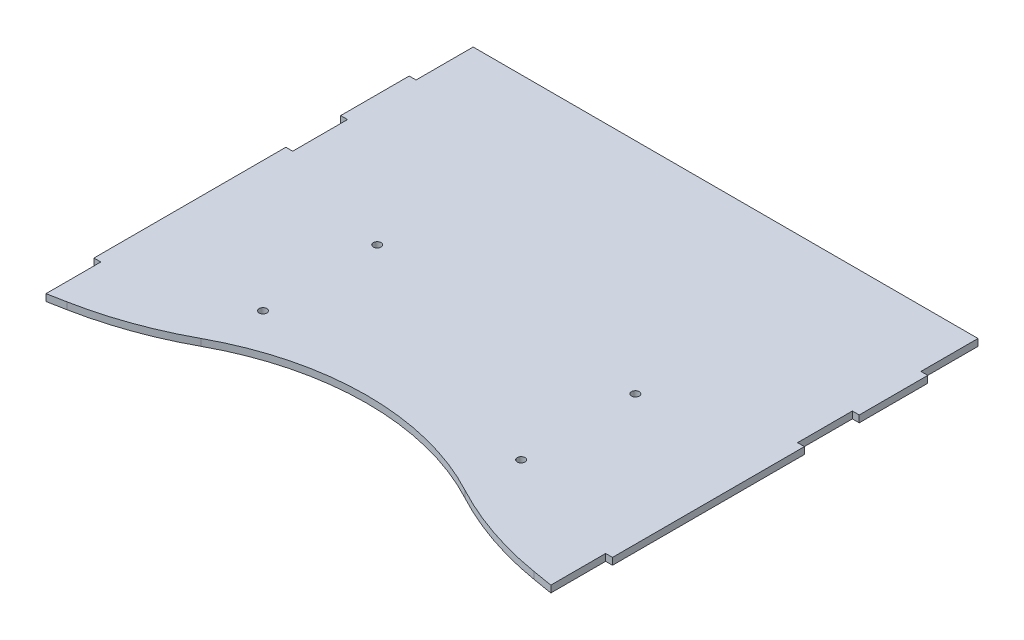
ISO-10303-21;
HEADER;
FILE_DESCRIPTION(('STEP AP214'),'2;1');
FILE_NAME('part.step','',(''),(''),'','','');
FILE_SCHEMA(('AUTOMOTIVE_DESIGN { 1 0 10303 214 1 1 1 1 }'));
ENDSEC;
DATA;
#1=APPLICATION_CONTEXT('core data for automotive mechanical design processes');
#2=APPLICATION_PROTOCOL_DEFINITION('international standard','automotive_design',2000,#1);
#3=PRODUCT_CONTEXT('',#1,'mechanical');
#4=PRODUCT('Part','Part','',(#3));
#5=PRODUCT_RELATED_PRODUCT_CATEGORY('part','',(#4));
#6=PRODUCT_DEFINITION_FORMATION('','',#4);
#7=PRODUCT_DEFINITION_CONTEXT('part definition',#1,'design');
#8=PRODUCT_DEFINITION('design','',#6,#7);
#9=PRODUCT_DEFINITION_SHAPE('','',#8);
#10=(LENGTH_UNIT() NAMED_UNIT(*) SI_UNIT(.MILLI.,.METRE.));
#11=(NAMED_UNIT(*) PLANE_ANGLE_UNIT() SI_UNIT($,.RADIAN.));
#12=(NAMED_UNIT(*) SI_UNIT($,.STERADIAN.) SOLID_ANGLE_UNIT());
#13=UNCERTAINTY_MEASURE_WITH_UNIT(LENGTH_MEASURE(1.E-05),#10,'distance_accuracy_value','');
#14=(GEOMETRIC_REPRESENTATION_CONTEXT(3) GLOBAL_UNCERTAINTY_ASSIGNED_CONTEXT((#13)) GLOBAL_UNIT_ASSIGNED_CONTEXT((#10,
#11,#12)) REPRESENTATION_CONTEXT('',''));
#15=CARTESIAN_POINT('',(0.,0.,0.));
#16=DIRECTION('',(0.,0.,1.));
#17=DIRECTION('',(1.,0.,0.));
#18=AXIS2_PLACEMENT_3D('',#15,#16,#17);
#19=CARTESIAN_POINT('',(-119.988319576707,3.,-50.7864686488141));
#20=DIRECTION('',(0.,1.,0.));
#21=DIRECTION('',(0.,0.,1.));
#22=AXIS2_PLACEMENT_3D('',#19,#20,#21);
#23=PLANE('',#22);
#24=CARTESIAN_POINT('',(67.6229243621729,3.,56.9943063968676));
#25=DIRECTION('',(0.,1.,0.));
#26=DIRECTION('',(0.,0.,1.));
#27=AXIS2_PLACEMENT_3D('',#24,#25,#26);
#28=CIRCLE('',#27,1.70000000000836);
#29=CARTESIAN_POINT('',(67.6229243621729,3.,58.694306396876));
#30=VERTEX_POINT('',#29);
#31=EDGE_CURVE('E532',#30,#30,#28,.T.);
#32=ORIENTED_EDGE('',*,*,#31,.F.);
#33=EDGE_LOOP('',(#32));
#34=FACE_BOUND('',#33,.T.);
#35=CARTESIAN_POINT('',(-45.3780371580943,3.,56.9943063968676));
#36=DIRECTION('',(0.,1.,0.));
#37=DIRECTION('',(0.,0.,-1.));
#38=AXIS2_PLACEMENT_3D('',#35,#36,#37);
#39=CIRCLE('',#38,1.70000000000835);
#40=CARTESIAN_POINT('',(-45.3780371580943,3.,55.2943063968593));
#41=VERTEX_POINT('',#40);
#42=EDGE_CURVE('E250',#41,#41,#39,.T.);
#43=ORIENTED_EDGE('',*,*,#42,.F.);
#44=EDGE_LOOP('',(#43));
#45=FACE_BOUND('',#44,.T.);
#46=DIRECTION('',(1.,0.,0.));
#47=VECTOR('',#46,1.);
#48=CARTESIAN_POINT('',(121.622443602039,3.,-34.0058768468031));
#49=LINE('',#48,#47);
#50=CARTESIAN_POINT('',(121.622443602039,3.,-34.0058768468031));
#51=VERTEX_POINT('',#50);
#52=CARTESIAN_POINT('',(124.622443602039,3.,-34.0058768468031));
#53=VERTEX_POINT('',#52);
#54=EDGE_CURVE('E316',#51,#53,#49,.T.);
#55=ORIENTED_EDGE('',*,*,#54,.T.);
#56=DIRECTION('',(0.,0.,-1.));
#57=VECTOR('',#56,1.);
#58=CARTESIAN_POINT('',(124.622443602039,3.,-34.0058768468031));
#59=LINE('',#58,#57);
#60=CARTESIAN_POINT('',(124.622443602039,3.,-64.0058768468031));
#61=VERTEX_POINT('',#60);
#62=EDGE_CURVE('E156',#53,#61,#59,.T.);
#63=ORIENTED_EDGE('',*,*,#62,.T.);
#64=DIRECTION('',(-1.,0.,0.));
#65=VECTOR('',#64,1.);
#66=CARTESIAN_POINT('',(124.622443602039,3.,-64.0058768468031));
#67=LINE('',#66,#65);
#68=CARTESIAN_POINT('',(121.622443602039,3.,-64.0058768468031));
#69=VERTEX_POINT('',#68);
#70=EDGE_CURVE('E401',#61,#69,#67,.T.);
#71=ORIENTED_EDGE('',*,*,#70,.T.);
#72=DIRECTION('',(0.,0.,-1.));
#73=VECTOR('',#72,1.);
#74=CARTESIAN_POINT('',(121.622443602039,3.,-64.0058768468031));
#75=LINE('',#74,#73);
#76=CARTESIAN_POINT('',(121.622443602039,3.,-89.0051120694086));
#77=VERTEX_POINT('',#76);
#78=EDGE_CURVE('E421',#69,#77,#75,.T.);
#79=ORIENTED_EDGE('',*,*,#78,.T.);
#80=DIRECTION('',(-0.999999999994578,0.,-3.29287633006143E-06));
#81=VECTOR('',#80,1.);
#82=CARTESIAN_POINT('',(-99.3775563979607,3.,-89.0058397950775));
#83=LINE('',#82,#81);
#84=CARTESIAN_POINT('',(-99.3775563979607,3.,-89.0058397950775));
#85=VERTEX_POINT('',#84);
#86=EDGE_CURVE('E417',#77,#85,#83,.T.);
#87=ORIENTED_EDGE('',*,*,#86,.T.);
#88=DIRECTION('',(0.,0.,1.));
#89=VECTOR('',#88,1.);
#90=CARTESIAN_POINT('',(-99.3775563979607,3.,-64.0058768468031));
#91=LINE('',#90,#89);
#92=CARTESIAN_POINT('',(-99.3775563979607,3.,-64.0058768468031));
#93=VERTEX_POINT('',#92);
#94=EDGE_CURVE('E420',#85,#93,#91,.T.);
#95=ORIENTED_EDGE('',*,*,#94,.T.);
#96=DIRECTION('',(-1.,0.,0.));
#97=VECTOR('',#96,1.);
#98=CARTESIAN_POINT('',(-102.377556397961,3.,-64.0058768468031));
#99=LINE('',#98,#97);
#100=CARTESIAN_POINT('',(-102.377556397961,3.,-64.0058768468031));
#101=VERTEX_POINT('',#100);
#102=EDGE_CURVE('E425',#93,#101,#99,.T.);
#103=ORIENTED_EDGE('',*,*,#102,.T.);
#104=DIRECTION('',(0.,0.,1.));
#105=VECTOR('',#104,1.);
#106=CARTESIAN_POINT('',(-102.377556397961,3.,-34.0058768468031));
#107=LINE('',#106,#105);
#108=CARTESIAN_POINT('',(-102.377556397961,3.,-34.0058768468031));
#109=VERTEX_POINT('',#108);
#110=EDGE_CURVE('E432',#101,#109,#107,.T.);
#111=ORIENTED_EDGE('',*,*,#110,.T.);
#112=DIRECTION('',(1.,0.,0.));
#113=VECTOR('',#112,1.);
#114=CARTESIAN_POINT('',(-99.3775563979607,3.,-34.0058768468031));
#115=LINE('',#114,#113);
#116=CARTESIAN_POINT('',(-99.3775563979607,3.,-34.0058768468031));
#117=VERTEX_POINT('',#116);
#118=EDGE_CURVE('E435',#109,#117,#115,.T.);
#119=ORIENTED_EDGE('',*,*,#118,.T.);
#120=DIRECTION('',(0.,0.,1.));
#121=VECTOR('',#120,1.);
#122=CARTESIAN_POINT('',(-99.3775563979607,3.,-10.0058768468031));
#123=LINE('',#122,#121);
#124=CARTESIAN_POINT('',(-99.3775563979607,3.,-10.0058768468031));
#125=VERTEX_POINT('',#124);
#126=EDGE_CURVE('E438',#117,#125,#123,.T.);
#127=ORIENTED_EDGE('',*,*,#126,.T.);
#128=DIRECTION('',(-1.,0.,0.));
#129=VECTOR('',#128,1.);
#130=CARTESIAN_POINT('',(-99.3775563979607,3.,-10.0058768468031));
#131=LINE('',#130,#129);
#132=CARTESIAN_POINT('',(-102.377556397961,3.,-10.0058768468031));
#133=VERTEX_POINT('',#132);
#134=EDGE_CURVE('E441',#125,#133,#131,.T.);
#135=ORIENTED_EDGE('',*,*,#134,.T.);
#136=DIRECTION('',(0.,0.,1.));
#137=VECTOR('',#136,1.);
#138=CARTESIAN_POINT('',(-102.377556397961,3.,-10.0058768468031));
#139=LINE('',#138,#137);
#140=CARTESIAN_POINT('',(-102.377556397961,3.,73.9941231531969));
#141=VERTEX_POINT('',#140);
#142=EDGE_CURVE('E444',#133,#141,#139,.T.);
#143=ORIENTED_EDGE('',*,*,#142,.T.);
#144=DIRECTION('',(1.,0.,0.));
#145=VECTOR('',#144,1.);
#146=CARTESIAN_POINT('',(-102.377556397961,3.,73.9941231531969));
#147=LINE('',#146,#145);
#148=CARTESIAN_POINT('',(-99.3775563979607,3.,73.9941231531969));
#149=VERTEX_POINT('',#148);
#150=EDGE_CURVE('E447',#141,#149,#147,.T.);
#151=ORIENTED_EDGE('',*,*,#150,.T.);
#152=DIRECTION('',(0.,0.,1.));
#153=VECTOR('',#152,1.);
#154=CARTESIAN_POINT('',(-99.3775563979607,3.,73.9941231531969));
#155=LINE('',#154,#153);
#156=CARTESIAN_POINT('',(-99.3775563979607,3.,97.9941231531969));
#157=VERTEX_POINT('',#156);
#158=EDGE_CURVE('E450',#149,#157,#155,.T.);
#159=ORIENTED_EDGE('',*,*,#158,.T.);
#160=DIRECTION('',(0.982108036493537,0.,-0.188318359845262));
#161=VECTOR('',#160,1.);
#162=CARTESIAN_POINT('',(-99.3775563979607,3.,97.9941231531969));
#163=LINE('',#162,#161);
#164=CARTESIAN_POINT('',(-91.7405655999169,3.,96.5297368252164));
#165=VERTEX_POINT('',#164);
#166=EDGE_CURVE('E453',#157,#165,#163,.T.);
#167=ORIENTED_EDGE('',*,*,#166,.T.);
#168=CARTESIAN_POINT('',(-119.988319576707,3.,-50.7864686488141));
#169=DIRECTION('',(0.,1.,0.));
#170=DIRECTION('',(0.,0.,1.));
#171=AXIS2_PLACEMENT_3D('',#168,#169,#170);
#172=CIRCLE('',#171,150.);
#173=CARTESIAN_POINT('',(-48.3937251013015,3.,81.0248132731151));
#174=VERTEX_POINT('',#173);
#175=EDGE_CURVE('E456',#165,#174,#172,.T.);
#176=ORIENTED_EDGE('',*,*,#175,.T.);
#177=CARTESIAN_POINT('',(9.42789835659181,3.,187.478971811722));
#178=DIRECTION('',(0.,-1.,0.));
#179=DIRECTION('',(0.,0.,1.));
#180=AXIS2_PLACEMENT_3D('',#177,#178,#179);
#181=CIRCLE('',#180,121.143831908476);
#182=CARTESIAN_POINT('',(66.7383594456825,3.,80.7487555689677));
#183=VERTEX_POINT('',#182);
#184=EDGE_CURVE('E459',#174,#183,#181,.T.);
#185=ORIENTED_EDGE('',*,*,#184,.T.);
#186=CARTESIAN_POINT('',(137.700033910943,3.,-51.4043403353141));
#187=DIRECTION('',(0.,1.,0.));
#188=DIRECTION('',(0.,0.,-1.));
#189=AXIS2_PLACEMENT_3D('',#186,#187,#188);
#190=CIRCLE('',#189,150.);
#191=CARTESIAN_POINT('',(112.890583802926,3.,96.5297368252164));
#192=VERTEX_POINT('',#191);
#193=EDGE_CURVE('E462',#183,#192,#190,.T.);
#194=ORIENTED_EDGE('',*,*,#193,.T.);
#195=DIRECTION('',(0.986227181070204,0.,0.165396334053447));
#196=VECTOR('',#195,1.);
#197=CARTESIAN_POINT('',(121.622443602039,3.,97.9941231531969));
#198=LINE('',#197,#196);
#199=CARTESIAN_POINT('',(121.622443602039,3.,97.9941231531969));
#200=VERTEX_POINT('',#199);
#201=EDGE_CURVE('E465',#192,#200,#198,.T.);
#202=ORIENTED_EDGE('',*,*,#201,.T.);
#203=DIRECTION('',(0.,0.,-1.));
#204=VECTOR('',#203,1.);
#205=CARTESIAN_POINT('',(121.622443602039,3.,73.9941231531969));
#206=LINE('',#205,#204);
#207=CARTESIAN_POINT('',(121.622443602039,3.,73.9941231531969));
#208=VERTEX_POINT('',#207);
#209=EDGE_CURVE('E468',#200,#208,#206,.T.);
#210=ORIENTED_EDGE('',*,*,#209,.T.);
#211=DIRECTION('',(1.,0.,0.));
#212=VECTOR('',#211,1.);
#213=CARTESIAN_POINT('',(124.622443602039,3.,73.9941231531969));
#214=LINE('',#213,#212);
#215=CARTESIAN_POINT('',(124.622443602039,3.,73.9941231531969));
#216=VERTEX_POINT('',#215);
#217=EDGE_CURVE('E223',#208,#216,#214,.T.);
#218=ORIENTED_EDGE('',*,*,#217,.T.);
#219=DIRECTION('',(0.,0.,-1.));
#220=VECTOR('',#219,1.);
#221=CARTESIAN_POINT('',(124.622443602039,3.,-10.0058768468031));
#222=LINE('',#221,#220);
#223=CARTESIAN_POINT('',(124.622443602039,3.,-10.0058768468031));
#224=VERTEX_POINT('',#223);
#225=EDGE_CURVE('E217',#216,#224,#222,.T.);
#226=ORIENTED_EDGE('',*,*,#225,.T.);
#227=DIRECTION('',(-1.,0.,0.));
#228=VECTOR('',#227,1.);
#229=CARTESIAN_POINT('',(121.622443602039,3.,-10.0058768468031));
#230=LINE('',#229,#228);
#231=CARTESIAN_POINT('',(121.622443602039,3.,-10.0058768468031));
#232=VERTEX_POINT('',#231);
#233=EDGE_CURVE('E221',#224,#232,#230,.T.);
#234=ORIENTED_EDGE('',*,*,#233,.T.);
#235=DIRECTION('',(0.,0.,-1.));
#236=VECTOR('',#235,1.);
#237=CARTESIAN_POINT('',(121.622443602039,3.,-10.0058768468031));
#238=LINE('',#237,#236);
#239=EDGE_CURVE('E65',#232,#51,#238,.T.);
#240=ORIENTED_EDGE('',*,*,#239,.T.);
#241=EDGE_LOOP('',(#55,#63,#71,#79,#87,#95,#103,#111,#119,#127,#135,#143,#151,#159,#167,#176,
#185,#194,#202,#210,#218,#226,#234,#240));
#242=FACE_BOUND('',#241,.T.);
#243=CARTESIAN_POINT('',(67.6227597183561,3.,6.99430639713869));
#244=DIRECTION('',(0.,1.,0.));
#245=DIRECTION('',(0.,0.,1.));
#246=AXIS2_PLACEMENT_3D('',#243,#244,#245);
#247=CIRCLE('',#246,1.69999999999292);
#248=CARTESIAN_POINT('',(67.6227597183561,3.,8.6943063971316));
#249=VERTEX_POINT('',#248);
#250=EDGE_CURVE('E540',#249,#249,#247,.T.);
#251=ORIENTED_EDGE('',*,*,#250,.F.);
#252=EDGE_LOOP('',(#251));
#253=FACE_BOUND('',#252,.T.);
#254=CARTESIAN_POINT('',(-45.3778725142775,3.,6.99430639713869));
#255=DIRECTION('',(0.,1.,0.));
#256=DIRECTION('',(0.,0.,-1.));
#257=AXIS2_PLACEMENT_3D('',#254,#255,#256);
#258=CIRCLE('',#257,1.69999999999292);
#259=CARTESIAN_POINT('',(-45.3778725142775,3.,5.29430639714577));
#260=VERTEX_POINT('',#259);
#261=EDGE_CURVE('E521',#260,#260,#258,.T.);
#262=ORIENTED_EDGE('',*,*,#261,.F.);
#263=EDGE_LOOP('',(#262));
#264=FACE_BOUND('',#263,.T.);
#265=ADVANCED_FACE('F47',(#34,#45,#242,#253,#264),#23,.T.);
#266=CARTESIAN_POINT('',(-119.988319576707,0.,-50.7864686488141));
#267=DIRECTION('',(0.,1.,0.));
#268=DIRECTION('',(0.,0.,1.));
#269=AXIS2_PLACEMENT_3D('',#266,#267,#268);
#270=PLANE('',#269);
#271=DIRECTION('',(1.,0.,0.));
#272=VECTOR('',#271,1.);
#273=CARTESIAN_POINT('',(121.622443602039,0.,-34.0058768468031));
#274=LINE('',#273,#272);
#275=CARTESIAN_POINT('',(121.622443602039,0.,-34.0058768468031));
#276=VERTEX_POINT('',#275);
#277=CARTESIAN_POINT('',(124.622443602039,0.,-34.0058768468031));
#278=VERTEX_POINT('',#277);
#279=EDGE_CURVE('E245',#276,#278,#274,.T.);
#280=ORIENTED_EDGE('',*,*,#279,.F.);
#281=DIRECTION('',(0.,0.,-1.));
#282=VECTOR('',#281,1.);
#283=CARTESIAN_POINT('',(121.622443602039,0.,-10.0058768468031));
#284=LINE('',#283,#282);
#285=CARTESIAN_POINT('',(121.622443602039,0.,-10.0058768468031));
#286=VERTEX_POINT('',#285);
#287=EDGE_CURVE('E148',#286,#276,#284,.T.);
#288=ORIENTED_EDGE('',*,*,#287,.F.);
#289=DIRECTION('',(-1.,0.,0.));
#290=VECTOR('',#289,1.);
#291=CARTESIAN_POINT('',(121.622443602039,0.,-10.0058768468031));
#292=LINE('',#291,#290);
#293=CARTESIAN_POINT('',(124.622443602039,0.,-10.0058768468031));
#294=VERTEX_POINT('',#293);
#295=EDGE_CURVE('E142',#294,#286,#292,.T.);
#296=ORIENTED_EDGE('',*,*,#295,.F.);
#297=DIRECTION('',(0.,0.,-1.));
#298=VECTOR('',#297,1.);
#299=CARTESIAN_POINT('',(124.622443602039,0.,-10.0058768468031));
#300=LINE('',#299,#298);
#301=CARTESIAN_POINT('',(124.622443602039,0.,73.9941231531969));
#302=VERTEX_POINT('',#301);
#303=EDGE_CURVE('E232',#302,#294,#300,.T.);
#304=ORIENTED_EDGE('',*,*,#303,.F.);
#305=DIRECTION('',(1.,0.,0.));
#306=VECTOR('',#305,1.);
#307=CARTESIAN_POINT('',(124.622443602039,0.,73.9941231531969));
#308=LINE('',#307,#306);
#309=CARTESIAN_POINT('',(121.622443602039,0.,73.9941231531969));
#310=VERTEX_POINT('',#309);
#311=EDGE_CURVE('E307',#310,#302,#308,.T.);
#312=ORIENTED_EDGE('',*,*,#311,.F.);
#313=DIRECTION('',(0.,0.,-1.));
#314=VECTOR('',#313,1.);
#315=CARTESIAN_POINT('',(121.622443602039,0.,73.9941231531969));
#316=LINE('',#315,#314);
#317=CARTESIAN_POINT('',(121.622443602039,0.,97.9941231531969));
#318=VERTEX_POINT('',#317);
#319=EDGE_CURVE('E304',#318,#310,#316,.T.);
#320=ORIENTED_EDGE('',*,*,#319,.F.);
#321=DIRECTION('',(0.986227181070204,0.,0.165396334053447));
#322=VECTOR('',#321,1.);
#323=CARTESIAN_POINT('',(121.622443602039,0.,97.9941231531969));
#324=LINE('',#323,#322);
#325=CARTESIAN_POINT('',(112.890583802926,0.,96.5297368252164));
#326=VERTEX_POINT('',#325);
#327=EDGE_CURVE('E301',#326,#318,#324,.T.);
#328=ORIENTED_EDGE('',*,*,#327,.F.);
#329=CARTESIAN_POINT('',(137.700033910943,0.,-51.4043403353141));
#330=DIRECTION('',(0.,1.,0.));
#331=DIRECTION('',(0.,0.,-1.));
#332=AXIS2_PLACEMENT_3D('',#329,#330,#331);
#333=CIRCLE('',#332,150.);
#334=CARTESIAN_POINT('',(66.7383594456825,0.,80.7487555689677));
#335=VERTEX_POINT('',#334);
#336=EDGE_CURVE('E298',#335,#326,#333,.T.);
#337=ORIENTED_EDGE('',*,*,#336,.F.);
#338=CARTESIAN_POINT('',(9.42789835659181,0.,187.478971811722));
#339=DIRECTION('',(0.,-1.,0.));
#340=DIRECTION('',(0.,0.,1.));
#341=AXIS2_PLACEMENT_3D('',#338,#339,#340);
#342=CIRCLE('',#341,121.143831908476);
#343=CARTESIAN_POINT('',(-48.3937251013015,0.,81.0248132731151));
#344=VERTEX_POINT('',#343);
#345=EDGE_CURVE('E295',#344,#335,#342,.T.);
#346=ORIENTED_EDGE('',*,*,#345,.F.);
#347=CARTESIAN_POINT('',(-119.988319576707,0.,-50.7864686488141));
#348=DIRECTION('',(0.,1.,0.));
#349=DIRECTION('',(0.,0.,1.));
#350=AXIS2_PLACEMENT_3D('',#347,#348,#349);
#351=CIRCLE('',#350,150.);
#352=CARTESIAN_POINT('',(-91.7405655999169,0.,96.5297368252164));
#353=VERTEX_POINT('',#352);
#354=EDGE_CURVE('E292',#353,#344,#351,.T.);
#355=ORIENTED_EDGE('',*,*,#354,.F.);
#356=DIRECTION('',(0.982108036493537,0.,-0.188318359845262));
#357=VECTOR('',#356,1.);
#358=CARTESIAN_POINT('',(-99.3775563979607,0.,97.9941231531969));
#359=LINE('',#358,#357);
#360=CARTESIAN_POINT('',(-99.3775563979607,0.,97.9941231531969));
#361=VERTEX_POINT('',#360);
#362=EDGE_CURVE('E289',#361,#353,#359,.T.);
#363=ORIENTED_EDGE('',*,*,#362,.F.);
#364=DIRECTION('',(0.,0.,1.));
#365=VECTOR('',#364,1.);
#366=CARTESIAN_POINT('',(-99.3775563979607,0.,73.9941231531969));
#367=LINE('',#366,#365);
#368=CARTESIAN_POINT('',(-99.3775563979607,0.,73.9941231531969));
#369=VERTEX_POINT('',#368);
#370=EDGE_CURVE('E286',#369,#361,#367,.T.);
#371=ORIENTED_EDGE('',*,*,#370,.F.);
#372=DIRECTION('',(1.,0.,0.));
#373=VECTOR('',#372,1.);
#374=CARTESIAN_POINT('',(-102.377556397961,0.,73.9941231531969));
#375=LINE('',#374,#373);
#376=CARTESIAN_POINT('',(-102.377556397961,0.,73.9941231531969));
#377=VERTEX_POINT('',#376);
#378=EDGE_CURVE('E283',#377,#369,#375,.T.);
#379=ORIENTED_EDGE('',*,*,#378,.F.);
#380=DIRECTION('',(0.,0.,1.));
#381=VECTOR('',#380,1.);
#382=CARTESIAN_POINT('',(-102.377556397961,0.,-10.0058768468031));
#383=LINE('',#382,#381);
#384=CARTESIAN_POINT('',(-102.377556397961,0.,-10.0058768468031));
#385=VERTEX_POINT('',#384);
#386=EDGE_CURVE('E280',#385,#377,#383,.T.);
#387=ORIENTED_EDGE('',*,*,#386,.F.);
#388=DIRECTION('',(-1.,0.,0.));
#389=VECTOR('',#388,1.);
#390=CARTESIAN_POINT('',(-99.3775563979607,0.,-10.0058768468031));
#391=LINE('',#390,#389);
#392=CARTESIAN_POINT('',(-99.3775563979607,0.,-10.0058768468031));
#393=VERTEX_POINT('',#392);
#394=EDGE_CURVE('E277',#393,#385,#391,.T.);
#395=ORIENTED_EDGE('',*,*,#394,.F.);
#396=DIRECTION('',(0.,0.,1.));
#397=VECTOR('',#396,1.);
#398=CARTESIAN_POINT('',(-99.3775563979607,0.,-10.0058768468031));
#399=LINE('',#398,#397);
#400=CARTESIAN_POINT('',(-99.3775563979607,0.,-34.0058768468031));
#401=VERTEX_POINT('',#400);
#402=EDGE_CURVE('E274',#401,#393,#399,.T.);
#403=ORIENTED_EDGE('',*,*,#402,.F.);
#404=DIRECTION('',(1.,0.,0.));
#405=VECTOR('',#404,1.);
#406=CARTESIAN_POINT('',(-99.3775563979607,0.,-34.0058768468031));
#407=LINE('',#406,#405);
#408=CARTESIAN_POINT('',(-102.377556397961,0.,-34.0058768468031));
#409=VERTEX_POINT('',#408);
#410=EDGE_CURVE('E271',#409,#401,#407,.T.);
#411=ORIENTED_EDGE('',*,*,#410,.F.);
#412=DIRECTION('',(0.,0.,1.));
#413=VECTOR('',#412,1.);
#414=CARTESIAN_POINT('',(-102.377556397961,0.,-34.0058768468031));
#415=LINE('',#414,#413);
#416=CARTESIAN_POINT('',(-102.377556397961,0.,-64.0058768468031));
#417=VERTEX_POINT('',#416);
#418=EDGE_CURVE('E268',#417,#409,#415,.T.);
#419=ORIENTED_EDGE('',*,*,#418,.F.);
#420=DIRECTION('',(-1.,0.,0.));
#421=VECTOR('',#420,1.);
#422=CARTESIAN_POINT('',(-102.377556397961,0.,-64.0058768468031));
#423=LINE('',#422,#421);
#424=CARTESIAN_POINT('',(-99.3775563979607,0.,-64.0058768468031));
#425=VERTEX_POINT('',#424);
#426=EDGE_CURVE('E265',#425,#417,#423,.T.);
#427=ORIENTED_EDGE('',*,*,#426,.F.);
#428=DIRECTION('',(0.,0.,1.));
#429=VECTOR('',#428,1.);
#430=CARTESIAN_POINT('',(-99.3775563979607,0.,-64.0058768468031));
#431=LINE('',#430,#429);
#432=CARTESIAN_POINT('',(-99.3775563979607,0.,-89.0058397950775));
#433=VERTEX_POINT('',#432);
#434=EDGE_CURVE('E262',#433,#425,#431,.T.);
#435=ORIENTED_EDGE('',*,*,#434,.F.);
#436=DIRECTION('',(-0.999999999994578,0.,-3.29287633006143E-06));
#437=VECTOR('',#436,1.);
#438=CARTESIAN_POINT('',(-99.3775563979607,0.,-89.0058397950775));
#439=LINE('',#438,#437);
#440=CARTESIAN_POINT('',(121.622443602039,0.,-89.0051120694086));
#441=VERTEX_POINT('',#440);
#442=EDGE_CURVE('E259',#441,#433,#439,.T.);
#443=ORIENTED_EDGE('',*,*,#442,.F.);
#444=DIRECTION('',(0.,0.,-1.));
#445=VECTOR('',#444,1.);
#446=CARTESIAN_POINT('',(121.622443602039,0.,-64.0058768468031));
#447=LINE('',#446,#445);
#448=CARTESIAN_POINT('',(121.622443602039,0.,-64.0058768468031));
#449=VERTEX_POINT('',#448);
#450=EDGE_CURVE('E256',#449,#441,#447,.T.);
#451=ORIENTED_EDGE('',*,*,#450,.F.);
#452=DIRECTION('',(-1.,0.,0.));
#453=VECTOR('',#452,1.);
#454=CARTESIAN_POINT('',(124.622443602039,0.,-64.0058768468031));
#455=LINE('',#454,#453);
#456=CARTESIAN_POINT('',(124.622443602039,0.,-64.0058768468031));
#457=VERTEX_POINT('',#456);
#458=EDGE_CURVE('E253',#457,#449,#455,.T.);
#459=ORIENTED_EDGE('',*,*,#458,.F.);
#460=DIRECTION('',(0.,0.,-1.));
#461=VECTOR('',#460,1.);
#462=CARTESIAN_POINT('',(124.622443602039,0.,-34.0058768468031));
#463=LINE('',#462,#461);
#464=EDGE_CURVE('E249',#278,#457,#463,.T.);
#465=ORIENTED_EDGE('',*,*,#464,.F.);
#466=EDGE_LOOP('',(#280,#288,#296,#304,#312,#320,#328,#337,#346,#355,#363,#371,#379,#387,#395,
#403,#411,#419,#427,#435,#443,#451,#459,#465));
#467=FACE_BOUND('',#466,.T.);
#468=CARTESIAN_POINT('',(-45.3780371580943,0.,56.9943063968676));
#469=DIRECTION('',(0.,1.,0.));
#470=DIRECTION('',(0.,0.,-1.));
#471=AXIS2_PLACEMENT_3D('',#468,#469,#470);
#472=CIRCLE('',#471,1.70000000000835);
#473=CARTESIAN_POINT('',(-45.3780371580943,0.,55.2943063968593));
#474=VERTEX_POINT('',#473);
#475=EDGE_CURVE('E544',#474,#474,#472,.T.);
#476=ORIENTED_EDGE('',*,*,#475,.T.);
#477=EDGE_LOOP('',(#476));
#478=FACE_BOUND('',#477,.T.);
#479=CARTESIAN_POINT('',(67.6227597183561,0.,6.99430639713869));
#480=DIRECTION('',(0.,1.,0.));
#481=DIRECTION('',(0.,0.,1.));
#482=AXIS2_PLACEMENT_3D('',#479,#480,#481);
#483=CIRCLE('',#482,1.69999999999292);
#484=CARTESIAN_POINT('',(67.6227597183561,0.,8.6943063971316));
#485=VERTEX_POINT('',#484);
#486=EDGE_CURVE('E536',#485,#485,#483,.T.);
#487=ORIENTED_EDGE('',*,*,#486,.T.);
#488=EDGE_LOOP('',(#487));
#489=FACE_BOUND('',#488,.T.);
#490=CARTESIAN_POINT('',(67.6229243621729,0.,56.9943063968676));
#491=DIRECTION('',(0.,1.,0.));
#492=DIRECTION('',(0.,0.,1.));
#493=AXIS2_PLACEMENT_3D('',#490,#491,#492);
#494=CIRCLE('',#493,1.70000000000836);
#495=CARTESIAN_POINT('',(67.6229243621729,0.,58.694306396876));
#496=VERTEX_POINT('',#495);
#497=EDGE_CURVE('E529',#496,#496,#494,.T.);
#498=ORIENTED_EDGE('',*,*,#497,.T.);
#499=EDGE_LOOP('',(#498));
#500=FACE_BOUND('',#499,.T.);
#501=CARTESIAN_POINT('',(-45.3778725142775,0.,6.99430639713869));
#502=DIRECTION('',(0.,1.,0.));
#503=DIRECTION('',(0.,0.,-1.));
#504=AXIS2_PLACEMENT_3D('',#501,#502,#503);
#505=CIRCLE('',#504,1.69999999999292);
#506=CARTESIAN_POINT('',(-45.3778725142775,0.,5.29430639714577));
#507=VERTEX_POINT('',#506);
#508=EDGE_CURVE('E524',#507,#507,#505,.T.);
#509=ORIENTED_EDGE('',*,*,#508,.T.);
#510=EDGE_LOOP('',(#509));
#511=FACE_BOUND('',#510,.T.);
#512=ADVANCED_FACE('F405',(#467,#478,#489,#500,#511),#270,.F.);
#513=CARTESIAN_POINT('',(121.622443602039,3.,-34.0058768468031));
#514=DIRECTION('',(0.,0.,-1.));
#515=DIRECTION('',(-1.,0.,0.));
#516=AXIS2_PLACEMENT_3D('',#513,#514,#515);
#517=PLANE('',#516);
#518=ORIENTED_EDGE('',*,*,#279,.T.);
#519=DIRECTION('',(0.,-1.,0.));
#520=VECTOR('',#519,1.);
#521=CARTESIAN_POINT('',(124.622443602039,3.,-34.0058768468031));
#522=LINE('',#521,#520);
#523=EDGE_CURVE('E11',#53,#278,#522,.T.);
#524=ORIENTED_EDGE('',*,*,#523,.F.);
#525=ORIENTED_EDGE('',*,*,#54,.F.);
#526=DIRECTION('',(0.,-1.,0.));
#527=VECTOR('',#526,1.);
#528=CARTESIAN_POINT('',(121.622443602039,3.,-34.0058768468031));
#529=LINE('',#528,#527);
#530=EDGE_CURVE('E241',#51,#276,#529,.T.);
#531=ORIENTED_EDGE('',*,*,#530,.T.);
#532=EDGE_LOOP('',(#518,#524,#525,#531));
#533=FACE_BOUND('',#532,.T.);
#534=ADVANCED_FACE('F49',(#533),#517,.F.);
#535=CARTESIAN_POINT('',(124.622443602039,3.,-34.0058768468031));
#536=DIRECTION('',(-1.,0.,0.));
#537=DIRECTION('',(0.,0.,1.));
#538=AXIS2_PLACEMENT_3D('',#535,#536,#537);
#539=PLANE('',#538);
#540=ORIENTED_EDGE('',*,*,#464,.T.);
#541=DIRECTION('',(0.,-1.,0.));
#542=VECTOR('',#541,1.);
#543=CARTESIAN_POINT('',(124.622443602039,3.,-64.0058768468031));
#544=LINE('',#543,#542);
#545=EDGE_CURVE('E57',#61,#457,#544,.T.);
#546=ORIENTED_EDGE('',*,*,#545,.F.);
#547=ORIENTED_EDGE('',*,*,#62,.F.);
#548=ORIENTED_EDGE('',*,*,#523,.T.);
#549=EDGE_LOOP('',(#540,#546,#547,#548));
#550=FACE_BOUND('',#549,.T.);
#551=ADVANCED_FACE('F784',(#550),#539,.F.);
#552=CARTESIAN_POINT('',(124.622443602039,3.,-64.0058768468031));
#553=DIRECTION('',(0.,0.,1.));
#554=DIRECTION('',(1.,0.,0.));
#555=AXIS2_PLACEMENT_3D('',#552,#553,#554);
#556=PLANE('',#555);
#557=ORIENTED_EDGE('',*,*,#458,.T.);
#558=DIRECTION('',(0.,-1.,0.));
#559=VECTOR('',#558,1.);
#560=CARTESIAN_POINT('',(121.622443602039,3.,-64.0058768468031));
#561=LINE('',#560,#559);
#562=EDGE_CURVE('E391',#69,#449,#561,.T.);
#563=ORIENTED_EDGE('',*,*,#562,.F.);
#564=ORIENTED_EDGE('',*,*,#70,.F.);
#565=ORIENTED_EDGE('',*,*,#545,.T.);
#566=EDGE_LOOP('',(#557,#563,#564,#565));
#567=FACE_BOUND('',#566,.T.);
#568=ADVANCED_FACE('F399',(#567),#556,.F.);
#569=CARTESIAN_POINT('',(121.622443602039,3.,-64.0058768468031));
#570=DIRECTION('',(-1.,0.,0.));
#571=DIRECTION('',(0.,0.,1.));
#572=AXIS2_PLACEMENT_3D('',#569,#570,#571);
#573=PLANE('',#572);
#574=ORIENTED_EDGE('',*,*,#450,.T.);
#575=DIRECTION('',(0.,-1.,0.));
#576=VECTOR('',#575,1.);
#577=CARTESIAN_POINT('',(121.622443602039,3.,-89.0051120694086));
#578=LINE('',#577,#576);
#579=EDGE_CURVE('E387',#77,#441,#578,.T.);
#580=ORIENTED_EDGE('',*,*,#579,.F.);
#581=ORIENTED_EDGE('',*,*,#78,.F.);
#582=ORIENTED_EDGE('',*,*,#562,.T.);
#583=EDGE_LOOP('',(#574,#580,#581,#582));
#584=FACE_BOUND('',#583,.T.);
#585=ADVANCED_FACE('F411',(#584),#573,.F.);
#586=CARTESIAN_POINT('',(-99.3775563979607,3.,-89.0058397950775));
#587=DIRECTION('',(-3.29287633006143E-06,0.,0.999999999994579));
#588=DIRECTION('',(0.999999999994579,0.,3.29287633006143E-06));
#589=AXIS2_PLACEMENT_3D('',#586,#587,#588);
#590=PLANE('',#589);
#591=ORIENTED_EDGE('',*,*,#442,.T.);
#592=DIRECTION('',(0.,-1.,0.));
#593=VECTOR('',#592,1.);
#594=CARTESIAN_POINT('',(-99.3775563979607,3.,-89.0058397950775));
#595=LINE('',#594,#593);
#596=EDGE_CURVE('E383',#85,#433,#595,.T.);
#597=ORIENTED_EDGE('',*,*,#596,.F.);
#598=ORIENTED_EDGE('',*,*,#86,.F.);
#599=ORIENTED_EDGE('',*,*,#579,.T.);
#600=EDGE_LOOP('',(#591,#597,#598,#599));
#601=FACE_BOUND('',#600,.T.);
#602=ADVANCED_FACE('F415',(#601),#590,.F.);
#603=CARTESIAN_POINT('',(-99.3775563979607,3.,-64.0058768468031));
#604=DIRECTION('',(1.,0.,0.));
#605=DIRECTION('',(0.,0.,-1.));
#606=AXIS2_PLACEMENT_3D('',#603,#604,#605);
#607=PLANE('',#606);
#608=ORIENTED_EDGE('',*,*,#434,.T.);
#609=DIRECTION('',(0.,-1.,0.));
#610=VECTOR('',#609,1.);
#611=CARTESIAN_POINT('',(-99.3775563979607,3.,-64.0058768468031));
#612=LINE('',#611,#610);
#613=EDGE_CURVE('E379',#93,#425,#612,.T.);
#614=ORIENTED_EDGE('',*,*,#613,.F.);
#615=ORIENTED_EDGE('',*,*,#94,.F.);
#616=ORIENTED_EDGE('',*,*,#596,.T.);
#617=EDGE_LOOP('',(#608,#614,#615,#616));
#618=FACE_BOUND('',#617,.T.);
#619=ADVANCED_FACE('F749',(#618),#607,.F.);
#620=CARTESIAN_POINT('',(-102.377556397961,3.,-64.0058768468031));
#621=DIRECTION('',(0.,0.,1.));
#622=DIRECTION('',(1.,0.,0.));
#623=AXIS2_PLACEMENT_3D('',#620,#621,#622);
#624=PLANE('',#623);
#625=ORIENTED_EDGE('',*,*,#426,.T.);
#626=DIRECTION('',(0.,-1.,0.));
#627=VECTOR('',#626,1.);
#628=CARTESIAN_POINT('',(-102.377556397961,3.,-64.0058768468031));
#629=LINE('',#628,#627);
#630=EDGE_CURVE('E375',#101,#417,#629,.T.);
#631=ORIENTED_EDGE('',*,*,#630,.F.);
#632=ORIENTED_EDGE('',*,*,#102,.F.);
#633=ORIENTED_EDGE('',*,*,#613,.T.);
#634=EDGE_LOOP('',(#625,#631,#632,#633));
#635=FACE_BOUND('',#634,.T.);
#636=ADVANCED_FACE('F739',(#635),#624,.F.);
#637=CARTESIAN_POINT('',(-102.377556397961,3.,-34.0058768468031));
#638=DIRECTION('',(1.,0.,0.));
#639=DIRECTION('',(0.,0.,-1.));
#640=AXIS2_PLACEMENT_3D('',#637,#638,#639);
#641=PLANE('',#640);
#642=ORIENTED_EDGE('',*,*,#418,.T.);
#643=DIRECTION('',(0.,-1.,0.));
#644=VECTOR('',#643,1.);
#645=CARTESIAN_POINT('',(-102.377556397961,3.,-34.0058768468031));
#646=LINE('',#645,#644);
#647=EDGE_CURVE('E371',#109,#409,#646,.T.);
#648=ORIENTED_EDGE('',*,*,#647,.F.);
#649=ORIENTED_EDGE('',*,*,#110,.F.);
#650=ORIENTED_EDGE('',*,*,#630,.T.);
#651=EDGE_LOOP('',(#642,#648,#649,#650));
#652=FACE_BOUND('',#651,.T.);
#653=ADVANCED_FACE('F729',(#652),#641,.F.);
#654=CARTESIAN_POINT('',(-99.3775563979607,3.,-34.0058768468031));
#655=DIRECTION('',(0.,0.,-1.));
#656=DIRECTION('',(-1.,0.,0.));
#657=AXIS2_PLACEMENT_3D('',#654,#655,#656);
#658=PLANE('',#657);
#659=ORIENTED_EDGE('',*,*,#410,.T.);
#660=DIRECTION('',(0.,-1.,0.));
#661=VECTOR('',#660,1.);
#662=CARTESIAN_POINT('',(-99.3775563979607,3.,-34.0058768468031));
#663=LINE('',#662,#661);
#664=EDGE_CURVE('E367',#117,#401,#663,.T.);
#665=ORIENTED_EDGE('',*,*,#664,.F.);
#666=ORIENTED_EDGE('',*,*,#118,.F.);
#667=ORIENTED_EDGE('',*,*,#647,.T.);
#668=EDGE_LOOP('',(#659,#665,#666,#667));
#669=FACE_BOUND('',#668,.T.);
#670=ADVANCED_FACE('F719',(#669),#658,.F.);
#671=CARTESIAN_POINT('',(-99.3775563979607,3.,-10.0058768468031));
#672=DIRECTION('',(1.,0.,0.));
#673=DIRECTION('',(0.,0.,-1.));
#674=AXIS2_PLACEMENT_3D('',#671,#672,#673);
#675=PLANE('',#674);
#676=ORIENTED_EDGE('',*,*,#402,.T.);
#677=DIRECTION('',(0.,-1.,0.));
#678=VECTOR('',#677,1.);
#679=CARTESIAN_POINT('',(-99.3775563979607,3.,-10.0058768468031));
#680=LINE('',#679,#678);
#681=EDGE_CURVE('E363',#125,#393,#680,.T.);
#682=ORIENTED_EDGE('',*,*,#681,.F.);
#683=ORIENTED_EDGE('',*,*,#126,.F.);
#684=ORIENTED_EDGE('',*,*,#664,.T.);
#685=EDGE_LOOP('',(#676,#682,#683,#684));
#686=FACE_BOUND('',#685,.T.);
#687=ADVANCED_FACE('F709',(#686),#675,.F.);
#688=CARTESIAN_POINT('',(-99.3775563979607,3.,-10.0058768468031));
#689=DIRECTION('',(0.,0.,1.));
#690=DIRECTION('',(1.,0.,0.));
#691=AXIS2_PLACEMENT_3D('',#688,#689,#690);
#692=PLANE('',#691);
#693=ORIENTED_EDGE('',*,*,#394,.T.);
#694=DIRECTION('',(0.,-1.,0.));
#695=VECTOR('',#694,1.);
#696=CARTESIAN_POINT('',(-102.377556397961,3.,-10.0058768468031));
#697=LINE('',#696,#695);
#698=EDGE_CURVE('E359',#133,#385,#697,.T.);
#699=ORIENTED_EDGE('',*,*,#698,.F.);
#700=ORIENTED_EDGE('',*,*,#134,.F.);
#701=ORIENTED_EDGE('',*,*,#681,.T.);
#702=EDGE_LOOP('',(#693,#699,#700,#701));
#703=FACE_BOUND('',#702,.T.);
#704=ADVANCED_FACE('F699',(#703),#692,.F.);
#705=CARTESIAN_POINT('',(-102.377556397961,3.,-10.0058768468031));
#706=DIRECTION('',(1.,0.,0.));
#707=DIRECTION('',(0.,0.,-1.));
#708=AXIS2_PLACEMENT_3D('',#705,#706,#707);
#709=PLANE('',#708);
#710=ORIENTED_EDGE('',*,*,#386,.T.);
#711=DIRECTION('',(0.,-1.,0.));
#712=VECTOR('',#711,1.);
#713=CARTESIAN_POINT('',(-102.377556397961,3.,73.9941231531969));
#714=LINE('',#713,#712);
#715=EDGE_CURVE('E355',#141,#377,#714,.T.);
#716=ORIENTED_EDGE('',*,*,#715,.F.);
#717=ORIENTED_EDGE('',*,*,#142,.F.);
#718=ORIENTED_EDGE('',*,*,#698,.T.);
#719=EDGE_LOOP('',(#710,#716,#717,#718));
#720=FACE_BOUND('',#719,.T.);
#721=ADVANCED_FACE('F689',(#720),#709,.F.);
#722=CARTESIAN_POINT('',(-102.377556397961,3.,73.9941231531969));
#723=DIRECTION('',(0.,0.,-1.));
#724=DIRECTION('',(-1.,0.,0.));
#725=AXIS2_PLACEMENT_3D('',#722,#723,#724);
#726=PLANE('',#725);
#727=ORIENTED_EDGE('',*,*,#378,.T.);
#728=DIRECTION('',(0.,-1.,0.));
#729=VECTOR('',#728,1.);
#730=CARTESIAN_POINT('',(-99.3775563979607,3.,73.9941231531969));
#731=LINE('',#730,#729);
#732=EDGE_CURVE('E351',#149,#369,#731,.T.);
#733=ORIENTED_EDGE('',*,*,#732,.F.);
#734=ORIENTED_EDGE('',*,*,#150,.F.);
#735=ORIENTED_EDGE('',*,*,#715,.T.);
#736=EDGE_LOOP('',(#727,#733,#734,#735));
#737=FACE_BOUND('',#736,.T.);
#738=ADVANCED_FACE('F679',(#737),#726,.F.);
#739=CARTESIAN_POINT('',(-99.3775563979607,3.,73.9941231531969));
#740=DIRECTION('',(1.,0.,0.));
#741=DIRECTION('',(0.,0.,-1.));
#742=AXIS2_PLACEMENT_3D('',#739,#740,#741);
#743=PLANE('',#742);
#744=ORIENTED_EDGE('',*,*,#370,.T.);
#745=DIRECTION('',(0.,-1.,0.));
#746=VECTOR('',#745,1.);
#747=CARTESIAN_POINT('',(-99.3775563979607,3.,97.9941231531969));
#748=LINE('',#747,#746);
#749=EDGE_CURVE('E347',#157,#361,#748,.T.);
#750=ORIENTED_EDGE('',*,*,#749,.F.);
#751=ORIENTED_EDGE('',*,*,#158,.F.);
#752=ORIENTED_EDGE('',*,*,#732,.T.);
#753=EDGE_LOOP('',(#744,#750,#751,#752));
#754=FACE_BOUND('',#753,.T.);
#755=ADVANCED_FACE('F669',(#754),#743,.F.);
#756=CARTESIAN_POINT('',(-99.3775563979607,3.,97.9941231531969));
#757=DIRECTION('',(-0.188318359845262,0.,-0.982108036493537));
#758=DIRECTION('',(-0.982108036493537,0.,0.188318359845262));
#759=AXIS2_PLACEMENT_3D('',#756,#757,#758);
#760=PLANE('',#759);
#761=ORIENTED_EDGE('',*,*,#362,.T.);
#762=DIRECTION('',(0.,-1.,0.));
#763=VECTOR('',#762,1.);
#764=CARTESIAN_POINT('',(-91.7405655999169,3.,96.5297368252164));
#765=LINE('',#764,#763);
#766=EDGE_CURVE('E343',#165,#353,#765,.T.);
#767=ORIENTED_EDGE('',*,*,#766,.F.);
#768=ORIENTED_EDGE('',*,*,#166,.F.);
#769=ORIENTED_EDGE('',*,*,#749,.T.);
#770=EDGE_LOOP('',(#761,#767,#768,#769));
#771=FACE_BOUND('',#770,.T.);
#772=ADVANCED_FACE('F659',(#771),#760,.F.);
#773=CARTESIAN_POINT('',(-119.988319576707,3.,-50.7864686488141));
#774=DIRECTION('',(0.,-1.,0.));
#775=DIRECTION('',(0.,0.,-1.));
#776=AXIS2_PLACEMENT_3D('',#773,#774,#775);
#777=CYLINDRICAL_SURFACE('',#776,150.);
#778=ORIENTED_EDGE('',*,*,#354,.T.);
#779=DIRECTION('',(0.,-1.,0.));
#780=VECTOR('',#779,1.);
#781=CARTESIAN_POINT('',(-48.3937251013015,3.,81.0248132731151));
#782=LINE('',#781,#780);
#783=EDGE_CURVE('E339',#174,#344,#782,.T.);
#784=ORIENTED_EDGE('',*,*,#783,.F.);
#785=ORIENTED_EDGE('',*,*,#175,.F.);
#786=ORIENTED_EDGE('',*,*,#766,.T.);
#787=EDGE_LOOP('',(#778,#784,#785,#786));
#788=FACE_BOUND('',#787,.T.);
#789=ADVANCED_FACE('F649',(#788),#777,.T.);
#790=CARTESIAN_POINT('',(9.42789835659181,3.,187.478971811722));
#791=DIRECTION('',(0.,-1.,0.));
#792=DIRECTION('',(0.,0.,-1.));
#793=AXIS2_PLACEMENT_3D('',#790,#791,#792);
#794=CYLINDRICAL_SURFACE('',#793,121.143831908476);
#795=ORIENTED_EDGE('',*,*,#345,.T.);
#796=DIRECTION('',(0.,-1.,0.));
#797=VECTOR('',#796,1.);
#798=CARTESIAN_POINT('',(66.7383594456825,3.,80.7487555689677));
#799=LINE('',#798,#797);
#800=EDGE_CURVE('E335',#183,#335,#799,.T.);
#801=ORIENTED_EDGE('',*,*,#800,.F.);
#802=ORIENTED_EDGE('',*,*,#184,.F.);
#803=ORIENTED_EDGE('',*,*,#783,.T.);
#804=EDGE_LOOP('',(#795,#801,#802,#803));
#805=FACE_BOUND('',#804,.T.);
#806=ADVANCED_FACE('F639',(#805),#794,.F.);
#807=CARTESIAN_POINT('',(137.700033910943,3.,-51.4043403353141));
#808=DIRECTION('',(0.,-1.,0.));
#809=DIRECTION('',(0.,0.,-1.));
#810=AXIS2_PLACEMENT_3D('',#807,#808,#809);
#811=CYLINDRICAL_SURFACE('',#810,150.);
#812=ORIENTED_EDGE('',*,*,#336,.T.);
#813=DIRECTION('',(0.,-1.,0.));
#814=VECTOR('',#813,1.);
#815=CARTESIAN_POINT('',(112.890583802926,3.,96.5297368252164));
#816=LINE('',#815,#814);
#817=EDGE_CURVE('E331',#192,#326,#816,.T.);
#818=ORIENTED_EDGE('',*,*,#817,.F.);
#819=ORIENTED_EDGE('',*,*,#193,.F.);
#820=ORIENTED_EDGE('',*,*,#800,.T.);
#821=EDGE_LOOP('',(#812,#818,#819,#820));
#822=FACE_BOUND('',#821,.T.);
#823=ADVANCED_FACE('F629',(#822),#811,.T.);
#824=CARTESIAN_POINT('',(121.622443602039,3.,97.9941231531969));
#825=DIRECTION('',(0.165396334053447,0.,-0.986227181070204));
#826=DIRECTION('',(-0.986227181070204,0.,-0.165396334053447));
#827=AXIS2_PLACEMENT_3D('',#824,#825,#826);
#828=PLANE('',#827);
#829=ORIENTED_EDGE('',*,*,#327,.T.);
#830=DIRECTION('',(0.,-1.,0.));
#831=VECTOR('',#830,1.);
#832=CARTESIAN_POINT('',(121.622443602039,3.,97.9941231531969));
#833=LINE('',#832,#831);
#834=EDGE_CURVE('E327',#200,#318,#833,.T.);
#835=ORIENTED_EDGE('',*,*,#834,.F.);
#836=ORIENTED_EDGE('',*,*,#201,.F.);
#837=ORIENTED_EDGE('',*,*,#817,.T.);
#838=EDGE_LOOP('',(#829,#835,#836,#837));
#839=FACE_BOUND('',#838,.T.);
#840=ADVANCED_FACE('F620',(#839),#828,.F.);
#841=CARTESIAN_POINT('',(121.622443602039,3.,73.9941231531969));
#842=DIRECTION('',(-1.,0.,0.));
#843=DIRECTION('',(0.,0.,1.));
#844=AXIS2_PLACEMENT_3D('',#841,#842,#843);
#845=PLANE('',#844);
#846=ORIENTED_EDGE('',*,*,#319,.T.);
#847=DIRECTION('',(0.,-1.,0.));
#848=VECTOR('',#847,1.);
#849=CARTESIAN_POINT('',(121.622443602039,3.,73.9941231531969));
#850=LINE('',#849,#848);
#851=EDGE_CURVE('E323',#208,#310,#850,.T.);
#852=ORIENTED_EDGE('',*,*,#851,.F.);
#853=ORIENTED_EDGE('',*,*,#209,.F.);
#854=ORIENTED_EDGE('',*,*,#834,.T.);
#855=EDGE_LOOP('',(#846,#852,#853,#854));
#856=FACE_BOUND('',#855,.T.);
#857=ADVANCED_FACE('F476',(#856),#845,.F.);
#858=CARTESIAN_POINT('',(124.622443602039,3.,73.9941231531969));
#859=DIRECTION('',(0.,0.,-1.));
#860=DIRECTION('',(-1.,0.,0.));
#861=AXIS2_PLACEMENT_3D('',#858,#859,#860);
#862=PLANE('',#861);
#863=ORIENTED_EDGE('',*,*,#311,.T.);
#864=DIRECTION('',(0.,-1.,0.));
#865=VECTOR('',#864,1.);
#866=CARTESIAN_POINT('',(124.622443602039,3.,73.9941231531969));
#867=LINE('',#866,#865);
#868=EDGE_CURVE('E234',#216,#302,#867,.T.);
#869=ORIENTED_EDGE('',*,*,#868,.F.);
#870=ORIENTED_EDGE('',*,*,#217,.F.);
#871=ORIENTED_EDGE('',*,*,#851,.T.);
#872=EDGE_LOOP('',(#863,#869,#870,#871));
#873=FACE_BOUND('',#872,.T.);
#874=ADVANCED_FACE('F480',(#873),#862,.F.);
#875=CARTESIAN_POINT('',(124.622443602039,3.,-10.0058768468031));
#876=DIRECTION('',(-1.,0.,0.));
#877=DIRECTION('',(0.,0.,1.));
#878=AXIS2_PLACEMENT_3D('',#875,#876,#877);
#879=PLANE('',#878);
#880=ORIENTED_EDGE('',*,*,#303,.T.);
#881=DIRECTION('',(0.,-1.,0.));
#882=VECTOR('',#881,1.);
#883=CARTESIAN_POINT('',(124.622443602039,3.,-10.0058768468031));
#884=LINE('',#883,#882);
#885=EDGE_CURVE('E229',#224,#294,#884,.T.);
#886=ORIENTED_EDGE('',*,*,#885,.F.);
#887=ORIENTED_EDGE('',*,*,#225,.F.);
#888=ORIENTED_EDGE('',*,*,#868,.T.);
#889=EDGE_LOOP('',(#880,#886,#887,#888));
#890=FACE_BOUND('',#889,.T.);
#891=ADVANCED_FACE('F230',(#890),#879,.F.);
#892=CARTESIAN_POINT('',(121.622443602039,3.,-10.0058768468031));
#893=DIRECTION('',(0.,0.,1.));
#894=DIRECTION('',(1.,0.,0.));
#895=AXIS2_PLACEMENT_3D('',#892,#893,#894);
#896=PLANE('',#895);
#897=ORIENTED_EDGE('',*,*,#295,.T.);
#898=DIRECTION('',(0.,-1.,0.));
#899=VECTOR('',#898,1.);
#900=CARTESIAN_POINT('',(121.622443602039,3.,-10.0058768468031));
#901=LINE('',#900,#899);
#902=EDGE_CURVE('E235',#232,#286,#901,.T.);
#903=ORIENTED_EDGE('',*,*,#902,.F.);
#904=ORIENTED_EDGE('',*,*,#233,.F.);
#905=ORIENTED_EDGE('',*,*,#885,.T.);
#906=EDGE_LOOP('',(#897,#903,#904,#905));
#907=FACE_BOUND('',#906,.T.);
#908=ADVANCED_FACE('F237',(#907),#896,.F.);
#909=CARTESIAN_POINT('',(121.622443602039,3.,-10.0058768468031));
#910=DIRECTION('',(-1.,0.,0.));
#911=DIRECTION('',(0.,0.,1.));
#912=AXIS2_PLACEMENT_3D('',#909,#910,#911);
#913=PLANE('',#912);
#914=ORIENTED_EDGE('',*,*,#287,.T.);
#915=ORIENTED_EDGE('',*,*,#530,.F.);
#916=ORIENTED_EDGE('',*,*,#239,.F.);
#917=ORIENTED_EDGE('',*,*,#902,.T.);
#918=EDGE_LOOP('',(#914,#915,#916,#917));
#919=FACE_BOUND('',#918,.T.);
#920=ADVANCED_FACE('F484',(#919),#913,.F.);
#921=CARTESIAN_POINT('',(-45.3780371580943,3.,56.9943063968676));
#922=DIRECTION('',(0.,-1.,0.));
#923=DIRECTION('',(0.,0.,-1.));
#924=AXIS2_PLACEMENT_3D('',#921,#922,#923);
#925=CYLINDRICAL_SURFACE('',#924,1.70000000000835);
#926=ORIENTED_EDGE('',*,*,#42,.T.);
#927=EDGE_LOOP('',(#926));
#928=FACE_BOUND('',#927,.T.);
#929=ORIENTED_EDGE('',*,*,#475,.F.);
#930=EDGE_LOOP('',(#929));
#931=FACE_BOUND('',#930,.T.);
#932=ADVANCED_FACE('F486',(#928,#931),#925,.F.);
#933=CARTESIAN_POINT('',(67.6227597183561,3.,6.99430639713869));
#934=DIRECTION('',(0.,-1.,0.));
#935=DIRECTION('',(0.,0.,-1.));
#936=AXIS2_PLACEMENT_3D('',#933,#934,#935);
#937=CYLINDRICAL_SURFACE('',#936,1.69999999999292);
#938=ORIENTED_EDGE('',*,*,#250,.T.);
#939=EDGE_LOOP('',(#938));
#940=FACE_BOUND('',#939,.T.);
#941=ORIENTED_EDGE('',*,*,#486,.F.);
#942=EDGE_LOOP('',(#941));
#943=FACE_BOUND('',#942,.T.);
#944=ADVANCED_FACE('F492',(#940,#943),#937,.F.);
#945=CARTESIAN_POINT('',(67.6229243621729,3.,56.9943063968676));
#946=DIRECTION('',(0.,-1.,0.));
#947=DIRECTION('',(0.,0.,-1.));
#948=AXIS2_PLACEMENT_3D('',#945,#946,#947);
#949=CYLINDRICAL_SURFACE('',#948,1.70000000000836);
#950=ORIENTED_EDGE('',*,*,#31,.T.);
#951=EDGE_LOOP('',(#950));
#952=FACE_BOUND('',#951,.T.);
#953=ORIENTED_EDGE('',*,*,#497,.F.);
#954=EDGE_LOOP('',(#953));
#955=FACE_BOUND('',#954,.T.);
#956=ADVANCED_FACE('F508',(#952,#955),#949,.F.);
#957=CARTESIAN_POINT('',(-45.3778725142775,3.,6.99430639713869));
#958=DIRECTION('',(0.,-1.,0.));
#959=DIRECTION('',(0.,0.,-1.));
#960=AXIS2_PLACEMENT_3D('',#957,#958,#959);
#961=CYLINDRICAL_SURFACE('',#960,1.69999999999292);
#962=ORIENTED_EDGE('',*,*,#261,.T.);
#963=EDGE_LOOP('',(#962));
#964=FACE_BOUND('',#963,.T.);
#965=ORIENTED_EDGE('',*,*,#508,.F.);
#966=EDGE_LOOP('',(#965));
#967=FACE_BOUND('',#966,.T.);
#968=ADVANCED_FACE('F512',(#964,#967),#961,.F.);
#969=CLOSED_SHELL('',(#265,#512,#534,#551,#568,#585,#602,#619,#636,#653,#670,#687,#704,#721,
#738,#755,#772,#789,#806,#823,#840,#857,#874,#891,#908,#920,#932,#944,#956,#968));
#970=MANIFOLD_SOLID_BREP('B2',#969);
#971=ADVANCED_BREP_SHAPE_REPRESENTATION('',(#18,#970),#14);
#972=SHAPE_DEFINITION_REPRESENTATION(#9,#971);
ENDSEC;
END-ISO-10303-21;
